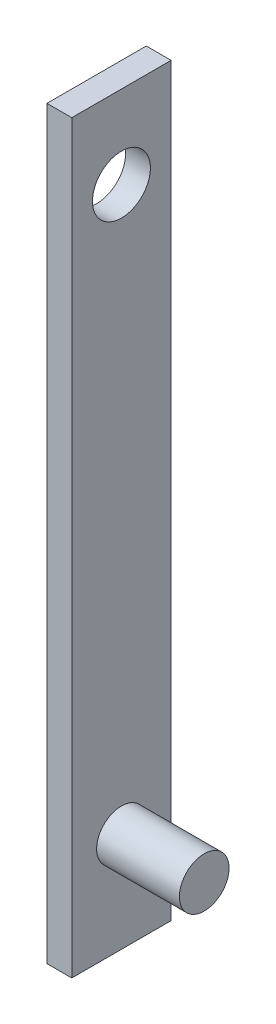
ISO-10303-21;
HEADER;
FILE_DESCRIPTION(('STEP AP214'),'2;1');
FILE_NAME('part.step','',(''),(''),'','','');
FILE_SCHEMA(('AUTOMOTIVE_DESIGN { 1 0 10303 214 1 1 1 1 }'));
ENDSEC;
DATA;
#1=APPLICATION_CONTEXT('core data for automotive mechanical design processes');
#2=APPLICATION_PROTOCOL_DEFINITION('international standard','automotive_design',2000,#1);
#3=PRODUCT_CONTEXT('',#1,'mechanical');
#4=PRODUCT('Part','Part','',(#3));
#5=PRODUCT_RELATED_PRODUCT_CATEGORY('part','',(#4));
#6=PRODUCT_DEFINITION_FORMATION('','',#4);
#7=PRODUCT_DEFINITION_CONTEXT('part definition',#1,'design');
#8=PRODUCT_DEFINITION('design','',#6,#7);
#9=PRODUCT_DEFINITION_SHAPE('','',#8);
#10=(LENGTH_UNIT() NAMED_UNIT(*) SI_UNIT(.MILLI.,.METRE.));
#11=(NAMED_UNIT(*) PLANE_ANGLE_UNIT() SI_UNIT($,.RADIAN.));
#12=(NAMED_UNIT(*) SI_UNIT($,.STERADIAN.) SOLID_ANGLE_UNIT());
#13=UNCERTAINTY_MEASURE_WITH_UNIT(LENGTH_MEASURE(1.E-05),#10,'distance_accuracy_value','');
#14=(GEOMETRIC_REPRESENTATION_CONTEXT(3) GLOBAL_UNCERTAINTY_ASSIGNED_CONTEXT((#13)) GLOBAL_UNIT_ASSIGNED_CONTEXT((#10,
#11,#12)) REPRESENTATION_CONTEXT('',''));
#15=CARTESIAN_POINT('',(0.,0.,0.));
#16=DIRECTION('',(0.,0.,1.));
#17=DIRECTION('',(1.,0.,0.));
#18=AXIS2_PLACEMENT_3D('',#15,#16,#17);
#19=CARTESIAN_POINT('',(3.,0.,0.));
#20=DIRECTION('',(-1.,0.,0.));
#21=DIRECTION('',(0.,0.,1.));
#22=AXIS2_PLACEMENT_3D('',#19,#20,#21);
#23=PLANE('',#22);
#24=DIRECTION('',(0.,1.,0.));
#25=VECTOR('',#24,1.);
#26=CARTESIAN_POINT('',(3.,-45.,-6.));
#27=LINE('',#26,#25);
#28=CARTESIAN_POINT('',(3.,-45.,-6.));
#29=VERTEX_POINT('',#28);
#30=CARTESIAN_POINT('',(3.,45.,-6.));
#31=VERTEX_POINT('',#30);
#32=EDGE_CURVE('E87',#29,#31,#27,.T.);
#33=ORIENTED_EDGE('',*,*,#32,.T.);
#34=DIRECTION('',(0.,0.,1.));
#35=VECTOR('',#34,1.);
#36=CARTESIAN_POINT('',(3.,45.,6.));
#37=LINE('',#36,#35);
#38=CARTESIAN_POINT('',(3.,45.,6.));
#39=VERTEX_POINT('',#38);
#40=EDGE_CURVE('E82',#31,#39,#37,.T.);
#41=ORIENTED_EDGE('',*,*,#40,.T.);
#42=DIRECTION('',(0.,-1.,0.));
#43=VECTOR('',#42,1.);
#44=CARTESIAN_POINT('',(3.,-45.,6.));
#45=LINE('',#44,#43);
#46=CARTESIAN_POINT('',(3.,-45.,6.));
#47=VERTEX_POINT('',#46);
#48=EDGE_CURVE('E85',#39,#47,#45,.T.);
#49=ORIENTED_EDGE('',*,*,#48,.T.);
#50=DIRECTION('',(0.,0.,-1.));
#51=VECTOR('',#50,1.);
#52=CARTESIAN_POINT('',(3.,-45.,6.));
#53=LINE('',#52,#51);
#54=EDGE_CURVE('E51',#47,#29,#53,.T.);
#55=ORIENTED_EDGE('',*,*,#54,.T.);
#56=EDGE_LOOP('',(#33,#41,#49,#55));
#57=FACE_BOUND('',#56,.T.);
#58=CARTESIAN_POINT('',(3.,35.,0.));
#59=DIRECTION('',(1.,0.,0.));
#60=DIRECTION('',(0.,0.,-1.));
#61=AXIS2_PLACEMENT_3D('',#58,#59,#60);
#62=CIRCLE('',#61,3.5);
#63=CARTESIAN_POINT('',(3.,35.,-3.5));
#64=VERTEX_POINT('',#63);
#65=EDGE_CURVE('E144',#64,#64,#62,.T.);
#66=ORIENTED_EDGE('',*,*,#65,.F.);
#67=EDGE_LOOP('',(#66));
#68=FACE_BOUND('',#67,.T.);
#69=CARTESIAN_POINT('',(3.,-33.,0.));
#70=DIRECTION('',(-1.,0.,0.));
#71=DIRECTION('',(0.,0.,1.));
#72=AXIS2_PLACEMENT_3D('',#69,#70,#71);
#73=CIRCLE('',#72,3.);
#74=CARTESIAN_POINT('',(3.,-33.,3.));
#75=VERTEX_POINT('',#74);
#76=EDGE_CURVE('E11',#75,#75,#73,.F.);
#77=ORIENTED_EDGE('',*,*,#76,.F.);
#78=EDGE_LOOP('',(#77));
#79=FACE_BOUND('',#78,.T.);
#80=ADVANCED_FACE('F34',(#57,#68,#79),#23,.F.);
#81=CARTESIAN_POINT('',(3.,-45.,-6.));
#82=DIRECTION('',(0.,0.,1.));
#83=DIRECTION('',(1.,0.,0.));
#84=AXIS2_PLACEMENT_3D('',#81,#82,#83);
#85=PLANE('',#84);
#86=DIRECTION('',(0.,1.,0.));
#87=VECTOR('',#86,1.);
#88=CARTESIAN_POINT('',(0.,-45.,-6.));
#89=LINE('',#88,#87);
#90=CARTESIAN_POINT('',(0.,-45.,-6.));
#91=VERTEX_POINT('',#90);
#92=CARTESIAN_POINT('',(0.,45.,-6.));
#93=VERTEX_POINT('',#92);
#94=EDGE_CURVE('E101',#91,#93,#89,.T.);
#95=ORIENTED_EDGE('',*,*,#94,.T.);
#96=DIRECTION('',(-1.,0.,0.));
#97=VECTOR('',#96,1.);
#98=CARTESIAN_POINT('',(3.,45.,-6.));
#99=LINE('',#98,#97);
#100=EDGE_CURVE('E43',#31,#93,#99,.T.);
#101=ORIENTED_EDGE('',*,*,#100,.F.);
#102=ORIENTED_EDGE('',*,*,#32,.F.);
#103=DIRECTION('',(-1.,0.,0.));
#104=VECTOR('',#103,1.);
#105=CARTESIAN_POINT('',(3.,-45.,-6.));
#106=LINE('',#105,#104);
#107=EDGE_CURVE('E97',#29,#91,#106,.T.);
#108=ORIENTED_EDGE('',*,*,#107,.T.);
#109=EDGE_LOOP('',(#95,#101,#102,#108));
#110=FACE_BOUND('',#109,.T.);
#111=ADVANCED_FACE('F36',(#110),#85,.F.);
#112=CARTESIAN_POINT('',(3.,45.,6.));
#113=DIRECTION('',(0.,-1.,0.));
#114=DIRECTION('',(0.,0.,-1.));
#115=AXIS2_PLACEMENT_3D('',#112,#113,#114);
#116=PLANE('',#115);
#117=DIRECTION('',(0.,0.,1.));
#118=VECTOR('',#117,1.);
#119=CARTESIAN_POINT('',(0.,45.,6.));
#120=LINE('',#119,#118);
#121=CARTESIAN_POINT('',(0.,45.,6.));
#122=VERTEX_POINT('',#121);
#123=EDGE_CURVE('E92',#93,#122,#120,.T.);
#124=ORIENTED_EDGE('',*,*,#123,.T.);
#125=DIRECTION('',(-1.,0.,0.));
#126=VECTOR('',#125,1.);
#127=CARTESIAN_POINT('',(3.,45.,6.));
#128=LINE('',#127,#126);
#129=EDGE_CURVE('E90',#39,#122,#128,.T.);
#130=ORIENTED_EDGE('',*,*,#129,.F.);
#131=ORIENTED_EDGE('',*,*,#40,.F.);
#132=ORIENTED_EDGE('',*,*,#100,.T.);
#133=EDGE_LOOP('',(#124,#130,#131,#132));
#134=FACE_BOUND('',#133,.T.);
#135=ADVANCED_FACE('F91',(#134),#116,.F.);
#136=CARTESIAN_POINT('',(3.,-45.,6.));
#137=DIRECTION('',(0.,0.,-1.));
#138=DIRECTION('',(-1.,0.,0.));
#139=AXIS2_PLACEMENT_3D('',#136,#137,#138);
#140=PLANE('',#139);
#141=DIRECTION('',(0.,-1.,0.));
#142=VECTOR('',#141,1.);
#143=CARTESIAN_POINT('',(0.,-45.,6.));
#144=LINE('',#143,#142);
#145=CARTESIAN_POINT('',(0.,-45.,6.));
#146=VERTEX_POINT('',#145);
#147=EDGE_CURVE('E68',#122,#146,#144,.T.);
#148=ORIENTED_EDGE('',*,*,#147,.T.);
#149=DIRECTION('',(-1.,0.,0.));
#150=VECTOR('',#149,1.);
#151=CARTESIAN_POINT('',(3.,-45.,6.));
#152=LINE('',#151,#150);
#153=EDGE_CURVE('E93',#47,#146,#152,.T.);
#154=ORIENTED_EDGE('',*,*,#153,.F.);
#155=ORIENTED_EDGE('',*,*,#48,.F.);
#156=ORIENTED_EDGE('',*,*,#129,.T.);
#157=EDGE_LOOP('',(#148,#154,#155,#156));
#158=FACE_BOUND('',#157,.T.);
#159=ADVANCED_FACE('F95',(#158),#140,.F.);
#160=CARTESIAN_POINT('',(3.,-45.,6.));
#161=DIRECTION('',(0.,1.,0.));
#162=DIRECTION('',(0.,0.,1.));
#163=AXIS2_PLACEMENT_3D('',#160,#161,#162);
#164=PLANE('',#163);
#165=DIRECTION('',(0.,0.,-1.));
#166=VECTOR('',#165,1.);
#167=CARTESIAN_POINT('',(0.,-45.,6.));
#168=LINE('',#167,#166);
#169=EDGE_CURVE('E74',#146,#91,#168,.T.);
#170=ORIENTED_EDGE('',*,*,#169,.T.);
#171=ORIENTED_EDGE('',*,*,#107,.F.);
#172=ORIENTED_EDGE('',*,*,#54,.F.);
#173=ORIENTED_EDGE('',*,*,#153,.T.);
#174=EDGE_LOOP('',(#170,#171,#172,#173));
#175=FACE_BOUND('',#174,.T.);
#176=ADVANCED_FACE('F115',(#175),#164,.F.);
#177=CARTESIAN_POINT('',(0.,0.,0.));
#178=DIRECTION('',(-1.,0.,0.));
#179=DIRECTION('',(0.,0.,1.));
#180=AXIS2_PLACEMENT_3D('',#177,#178,#179);
#181=PLANE('',#180);
#182=CARTESIAN_POINT('',(0.,35.,0.));
#183=DIRECTION('',(-1.,0.,0.));
#184=DIRECTION('',(0.,0.,1.));
#185=AXIS2_PLACEMENT_3D('',#182,#183,#184);
#186=CIRCLE('',#185,3.5);
#187=CARTESIAN_POINT('',(0.,35.,3.5));
#188=VERTEX_POINT('',#187);
#189=EDGE_CURVE('E104',#188,#188,#186,.F.);
#190=ORIENTED_EDGE('',*,*,#189,.T.);
#191=EDGE_LOOP('',(#190));
#192=FACE_BOUND('',#191,.T.);
#193=ORIENTED_EDGE('',*,*,#94,.F.);
#194=ORIENTED_EDGE('',*,*,#169,.F.);
#195=ORIENTED_EDGE('',*,*,#147,.F.);
#196=ORIENTED_EDGE('',*,*,#123,.F.);
#197=EDGE_LOOP('',(#193,#194,#195,#196));
#198=FACE_BOUND('',#197,.T.);
#199=ADVANCED_FACE('F112',(#192,#198),#181,.T.);
#200=CARTESIAN_POINT('',(-9.89949493661168,35.,0.));
#201=DIRECTION('',(1.,0.,0.));
#202=DIRECTION('',(0.,0.,-1.));
#203=AXIS2_PLACEMENT_3D('',#200,#201,#202);
#204=CYLINDRICAL_SURFACE('',#203,3.5);
#205=ORIENTED_EDGE('',*,*,#65,.T.);
#206=EDGE_LOOP('',(#205));
#207=FACE_BOUND('',#206,.T.);
#208=ORIENTED_EDGE('',*,*,#189,.F.);
#209=EDGE_LOOP('',(#208));
#210=FACE_BOUND('',#209,.T.);
#211=ADVANCED_FACE('F114',(#207,#210),#204,.F.);
#212=CARTESIAN_POINT('',(13.,-33.,0.));
#213=DIRECTION('',(-1.,0.,0.));
#214=DIRECTION('',(0.,0.,1.));
#215=AXIS2_PLACEMENT_3D('',#212,#213,#214);
#216=CYLINDRICAL_SURFACE('',#215,3.);
#217=CARTESIAN_POINT('',(13.,-33.,0.));
#218=DIRECTION('',(1.,0.,0.));
#219=DIRECTION('',(0.,0.,-1.));
#220=AXIS2_PLACEMENT_3D('',#217,#218,#219);
#221=CIRCLE('',#220,3.);
#222=CARTESIAN_POINT('',(13.,-33.,-3.));
#223=VERTEX_POINT('',#222);
#224=EDGE_CURVE('E143',#223,#223,#221,.T.);
#225=ORIENTED_EDGE('',*,*,#224,.F.);
#226=EDGE_LOOP('',(#225));
#227=FACE_BOUND('',#226,.T.);
#228=ORIENTED_EDGE('',*,*,#76,.T.);
#229=EDGE_LOOP('',(#228));
#230=FACE_BOUND('',#229,.T.);
#231=ADVANCED_FACE('F122',(#227,#230),#216,.T.);
#232=CARTESIAN_POINT('',(13.,-33.,0.));
#233=DIRECTION('',(1.,0.,0.));
#234=DIRECTION('',(0.,0.,-1.));
#235=AXIS2_PLACEMENT_3D('',#232,#233,#234);
#236=PLANE('',#235);
#237=ORIENTED_EDGE('',*,*,#224,.T.);
#238=EDGE_LOOP('',(#237));
#239=FACE_BOUND('',#238,.T.);
#240=ADVANCED_FACE('F135',(#239),#236,.T.);
#241=CLOSED_SHELL('',(#80,#111,#135,#159,#176,#199,#211,#231,#240));
#242=MANIFOLD_SOLID_BREP('B2',#241);
#243=ADVANCED_BREP_SHAPE_REPRESENTATION('',(#18,#242),#14);
#244=SHAPE_DEFINITION_REPRESENTATION(#9,#243);
ENDSEC;
END-ISO-10303-21;
